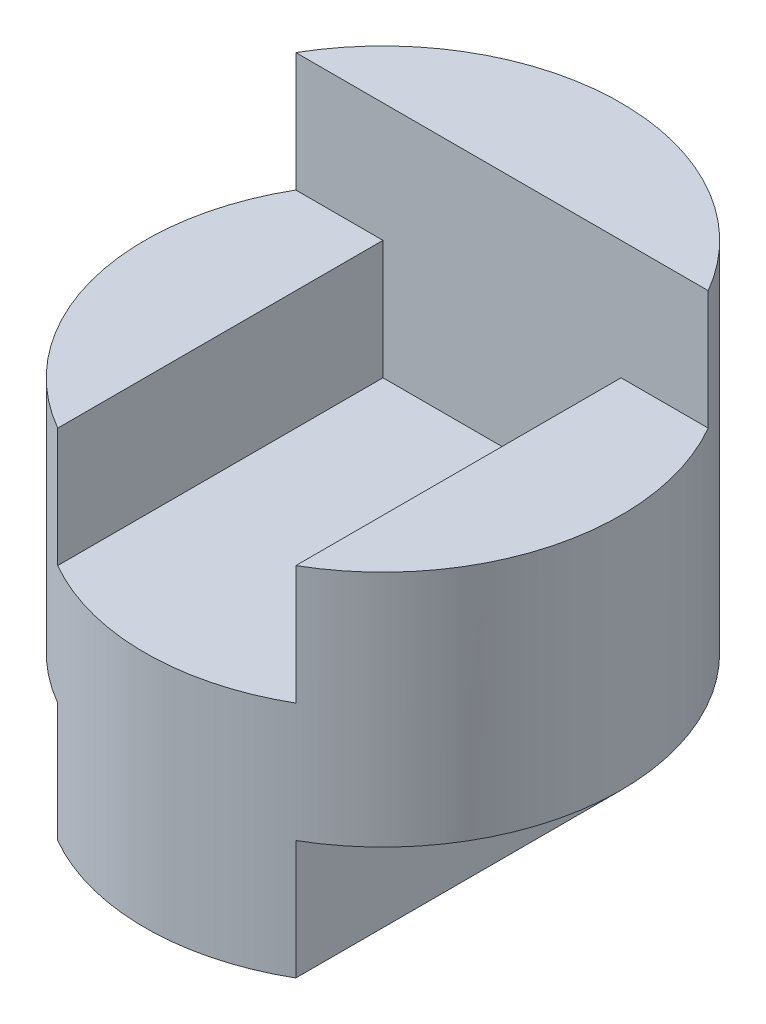
ISO-10303-21;
HEADER;
FILE_DESCRIPTION(('STEP AP214'),'2;1');
FILE_NAME('part.step','',(''),(''),'','','');
FILE_SCHEMA(('AUTOMOTIVE_DESIGN { 1 0 10303 214 1 1 1 1 }'));
ENDSEC;
DATA;
#1=APPLICATION_CONTEXT('core data for automotive mechanical design processes');
#2=APPLICATION_PROTOCOL_DEFINITION('international standard','automotive_design',2000,#1);
#3=PRODUCT_CONTEXT('',#1,'mechanical');
#4=PRODUCT('Part','Part','',(#3));
#5=PRODUCT_RELATED_PRODUCT_CATEGORY('part','',(#4));
#6=PRODUCT_DEFINITION_FORMATION('','',#4);
#7=PRODUCT_DEFINITION_CONTEXT('part definition',#1,'design');
#8=PRODUCT_DEFINITION('design','',#6,#7);
#9=PRODUCT_DEFINITION_SHAPE('','',#8);
#10=(LENGTH_UNIT() NAMED_UNIT(*) SI_UNIT(.MILLI.,.METRE.));
#11=(NAMED_UNIT(*) PLANE_ANGLE_UNIT() SI_UNIT($,.RADIAN.));
#12=(NAMED_UNIT(*) SI_UNIT($,.STERADIAN.) SOLID_ANGLE_UNIT());
#13=UNCERTAINTY_MEASURE_WITH_UNIT(LENGTH_MEASURE(1.E-05),#10,'distance_accuracy_value','');
#14=(GEOMETRIC_REPRESENTATION_CONTEXT(3) GLOBAL_UNCERTAINTY_ASSIGNED_CONTEXT((#13)) GLOBAL_UNIT_ASSIGNED_CONTEXT((#10,
#11,#12)) REPRESENTATION_CONTEXT('',''));
#15=CARTESIAN_POINT('',(0.,0.,0.));
#16=DIRECTION('',(0.,0.,1.));
#17=DIRECTION('',(1.,0.,0.));
#18=AXIS2_PLACEMENT_3D('',#15,#16,#17);
#19=CARTESIAN_POINT('',(0.,4.,0.));
#20=DIRECTION('',(0.,-1.,0.));
#21=DIRECTION('',(0.,0.,-1.));
#22=AXIS2_PLACEMENT_3D('',#19,#20,#21);
#23=CYLINDRICAL_SURFACE('',#22,2.);
#24=CARTESIAN_POINT('',(0.,1.,0.));
#25=DIRECTION('',(0.,1.,0.));
#26=DIRECTION('',(0.,0.,1.));
#27=AXIS2_PLACEMENT_3D('',#24,#25,#26);
#28=CIRCLE('',#27,2.);
#29=CARTESIAN_POINT('',(1.,1.,1.73205080756888));
#30=VERTEX_POINT('',#29);
#31=CARTESIAN_POINT('',(-1.,1.,1.73205080756888));
#32=VERTEX_POINT('',#31);
#33=EDGE_CURVE('E126',#30,#32,#28,.T.);
#34=ORIENTED_EDGE('',*,*,#33,.T.);
#35=DIRECTION('',(0.,-1.,0.));
#36=VECTOR('',#35,1.);
#37=CARTESIAN_POINT('',(-1.,4.,1.73205080756888));
#38=LINE('',#37,#36);
#39=CARTESIAN_POINT('',(-1.,0.,1.73205080756888));
#40=VERTEX_POINT('',#39);
#41=EDGE_CURVE('E136',#32,#40,#38,.T.);
#42=ORIENTED_EDGE('',*,*,#41,.T.);
#43=CARTESIAN_POINT('',(0.,0.,0.));
#44=DIRECTION('',(0.,1.,0.));
#45=DIRECTION('',(0.,0.,1.));
#46=AXIS2_PLACEMENT_3D('',#43,#44,#45);
#47=CIRCLE('',#46,2.);
#48=CARTESIAN_POINT('',(1.,0.,1.73205080756888));
#49=VERTEX_POINT('',#48);
#50=EDGE_CURVE('E139',#40,#49,#47,.T.);
#51=ORIENTED_EDGE('',*,*,#50,.T.);
#52=DIRECTION('',(0.,-1.,0.));
#53=VECTOR('',#52,1.);
#54=CARTESIAN_POINT('',(1.,4.,1.73205080756888));
#55=LINE('',#54,#53);
#56=EDGE_CURVE('E130',#49,#30,#55,.F.);
#57=ORIENTED_EDGE('',*,*,#56,.T.);
#58=EDGE_LOOP('',(#34,#42,#51,#57));
#59=FACE_BOUND('',#58,.T.);
#60=DIRECTION('',(0.,-1.,0.));
#61=VECTOR('',#60,1.);
#62=CARTESIAN_POINT('',(1.73205080756888,4.,-1.));
#63=LINE('',#62,#61);
#64=CARTESIAN_POINT('',(1.73205080756888,4.,-1.));
#65=VERTEX_POINT('',#64);
#66=CARTESIAN_POINT('',(1.73205080756888,3.,-1.));
#67=VERTEX_POINT('',#66);
#68=EDGE_CURVE('E55',#65,#67,#63,.T.);
#69=ORIENTED_EDGE('',*,*,#68,.T.);
#70=CARTESIAN_POINT('',(0.,3.,0.));
#71=DIRECTION('',(0.,1.,0.));
#72=DIRECTION('',(0.,0.,1.));
#73=AXIS2_PLACEMENT_3D('',#70,#71,#72);
#74=CIRCLE('',#73,2.);
#75=CARTESIAN_POINT('',(1.,3.,1.73205080756888));
#76=VERTEX_POINT('',#75);
#77=EDGE_CURVE('E40',#76,#67,#74,.T.);
#78=ORIENTED_EDGE('',*,*,#77,.F.);
#79=DIRECTION('',(0.,-1.,0.));
#80=VECTOR('',#79,1.);
#81=CARTESIAN_POINT('',(1.,4.,1.73205080756888));
#82=LINE('',#81,#80);
#83=CARTESIAN_POINT('',(1.,2.,1.73205080756888));
#84=VERTEX_POINT('',#83);
#85=EDGE_CURVE('E158',#84,#76,#82,.F.);
#86=ORIENTED_EDGE('',*,*,#85,.F.);
#87=CARTESIAN_POINT('',(0.,2.,0.));
#88=DIRECTION('',(0.,1.,0.));
#89=DIRECTION('',(-1.,0.,0.));
#90=AXIS2_PLACEMENT_3D('',#87,#88,#89);
#91=CIRCLE('',#90,2.);
#92=CARTESIAN_POINT('',(-1.,2.,1.73205080756888));
#93=VERTEX_POINT('',#92);
#94=EDGE_CURVE('E156',#93,#84,#91,.T.);
#95=ORIENTED_EDGE('',*,*,#94,.F.);
#96=DIRECTION('',(0.,-1.,0.));
#97=VECTOR('',#96,1.);
#98=CARTESIAN_POINT('',(-1.,4.,1.73205080756888));
#99=LINE('',#98,#97);
#100=CARTESIAN_POINT('',(-1.,3.,1.73205080756888));
#101=VERTEX_POINT('',#100);
#102=EDGE_CURVE('E154',#101,#93,#99,.T.);
#103=ORIENTED_EDGE('',*,*,#102,.F.);
#104=CARTESIAN_POINT('',(0.,3.,0.));
#105=DIRECTION('',(0.,1.,0.));
#106=DIRECTION('',(-1.,0.,0.));
#107=AXIS2_PLACEMENT_3D('',#104,#105,#106);
#108=CIRCLE('',#107,2.);
#109=CARTESIAN_POINT('',(-1.73205080756888,3.,-1.));
#110=VERTEX_POINT('',#109);
#111=EDGE_CURVE('E152',#110,#101,#108,.T.);
#112=ORIENTED_EDGE('',*,*,#111,.F.);
#113=DIRECTION('',(0.,-1.,0.));
#114=VECTOR('',#113,1.);
#115=CARTESIAN_POINT('',(-1.73205080756888,4.,-1.));
#116=LINE('',#115,#114);
#117=CARTESIAN_POINT('',(-1.73205080756888,4.,-1.));
#118=VERTEX_POINT('',#117);
#119=EDGE_CURVE('E132',#110,#118,#116,.F.);
#120=ORIENTED_EDGE('',*,*,#119,.T.);
#121=CARTESIAN_POINT('',(0.,4.,0.));
#122=DIRECTION('',(0.,1.,0.));
#123=DIRECTION('',(0.,0.,1.));
#124=AXIS2_PLACEMENT_3D('',#121,#122,#123);
#125=CIRCLE('',#124,2.);
#126=EDGE_CURVE('E140',#65,#118,#125,.T.);
#127=ORIENTED_EDGE('',*,*,#126,.F.);
#128=EDGE_LOOP('',(#69,#78,#86,#95,#103,#112,#120,#127));
#129=FACE_BOUND('',#128,.T.);
#130=ADVANCED_FACE('F33',(#59,#129),#23,.T.);
#131=CARTESIAN_POINT('',(0.,4.,0.));
#132=DIRECTION('',(0.,1.,0.));
#133=DIRECTION('',(0.,0.,1.));
#134=AXIS2_PLACEMENT_3D('',#131,#132,#133);
#135=PLANE('',#134);
#136=DIRECTION('',(-1.,0.,0.));
#137=VECTOR('',#136,1.);
#138=CARTESIAN_POINT('',(0.,4.,-1.));
#139=LINE('',#138,#137);
#140=EDGE_CURVE('E150',#65,#118,#139,.T.);
#141=ORIENTED_EDGE('',*,*,#140,.F.);
#142=ORIENTED_EDGE('',*,*,#126,.T.);
#143=EDGE_LOOP('',(#141,#142));
#144=FACE_BOUND('',#143,.T.);
#145=ADVANCED_FACE('F178',(#144),#135,.T.);
#146=CARTESIAN_POINT('',(0.,0.,0.));
#147=DIRECTION('',(0.,1.,0.));
#148=DIRECTION('',(0.,0.,1.));
#149=AXIS2_PLACEMENT_3D('',#146,#147,#148);
#150=PLANE('',#149);
#151=DIRECTION('',(0.,0.,-1.));
#152=VECTOR('',#151,1.);
#153=CARTESIAN_POINT('',(-1.,0.,0.));
#154=LINE('',#153,#152);
#155=CARTESIAN_POINT('',(-1.,0.,-1.));
#156=VERTEX_POINT('',#155);
#157=EDGE_CURVE('E146',#40,#156,#154,.T.);
#158=ORIENTED_EDGE('',*,*,#157,.T.);
#159=DIRECTION('',(1.,0.,0.));
#160=VECTOR('',#159,1.);
#161=CARTESIAN_POINT('',(-5.,0.,-1.));
#162=LINE('',#161,#160);
#163=CARTESIAN_POINT('',(1.,0.,-1.));
#164=VERTEX_POINT('',#163);
#165=EDGE_CURVE('E114',#156,#164,#162,.T.);
#166=ORIENTED_EDGE('',*,*,#165,.T.);
#167=DIRECTION('',(0.,0.,1.));
#168=VECTOR('',#167,1.);
#169=CARTESIAN_POINT('',(1.,0.,0.));
#170=LINE('',#169,#168);
#171=EDGE_CURVE('E122',#164,#49,#170,.T.);
#172=ORIENTED_EDGE('',*,*,#171,.T.);
#173=ORIENTED_EDGE('',*,*,#50,.F.);
#174=EDGE_LOOP('',(#158,#166,#172,#173));
#175=FACE_BOUND('',#174,.T.);
#176=ADVANCED_FACE('F211',(#175),#150,.F.);
#177=CARTESIAN_POINT('',(1.,0.,-2.));
#178=DIRECTION('',(-1.,0.,0.));
#179=DIRECTION('',(0.,0.,1.));
#180=AXIS2_PLACEMENT_3D('',#177,#178,#179);
#181=PLANE('',#180);
#182=ORIENTED_EDGE('',*,*,#171,.F.);
#183=DIRECTION('',(0.,1.,0.));
#184=VECTOR('',#183,1.);
#185=CARTESIAN_POINT('',(1.,0.,-1.));
#186=LINE('',#185,#184);
#187=CARTESIAN_POINT('',(1.,1.,-1.));
#188=VERTEX_POINT('',#187);
#189=EDGE_CURVE('E111',#164,#188,#186,.T.);
#190=ORIENTED_EDGE('',*,*,#189,.T.);
#191=DIRECTION('',(0.,0.,1.));
#192=VECTOR('',#191,1.);
#193=CARTESIAN_POINT('',(1.,1.,-2.));
#194=LINE('',#193,#192);
#195=EDGE_CURVE('E120',#188,#30,#194,.T.);
#196=ORIENTED_EDGE('',*,*,#195,.T.);
#197=ORIENTED_EDGE('',*,*,#56,.F.);
#198=EDGE_LOOP('',(#182,#190,#196,#197));
#199=FACE_BOUND('',#198,.T.);
#200=ADVANCED_FACE('F118',(#199),#181,.F.);
#201=CARTESIAN_POINT('',(-2.,1.,-2.));
#202=DIRECTION('',(0.,1.,0.));
#203=DIRECTION('',(0.,0.,1.));
#204=AXIS2_PLACEMENT_3D('',#201,#202,#203);
#205=PLANE('',#204);
#206=DIRECTION('',(0.,0.,1.));
#207=VECTOR('',#206,1.);
#208=CARTESIAN_POINT('',(-1.,1.,-2.));
#209=LINE('',#208,#207);
#210=CARTESIAN_POINT('',(-1.,1.,-1.));
#211=VERTEX_POINT('',#210);
#212=EDGE_CURVE('E128',#211,#32,#209,.T.);
#213=ORIENTED_EDGE('',*,*,#212,.T.);
#214=ORIENTED_EDGE('',*,*,#33,.F.);
#215=ORIENTED_EDGE('',*,*,#195,.F.);
#216=DIRECTION('',(1.,0.,0.));
#217=VECTOR('',#216,1.);
#218=CARTESIAN_POINT('',(-5.,1.,-1.));
#219=LINE('',#218,#217);
#220=EDGE_CURVE('E47',#211,#188,#219,.T.);
#221=ORIENTED_EDGE('',*,*,#220,.F.);
#222=EDGE_LOOP('',(#213,#214,#215,#221));
#223=FACE_BOUND('',#222,.T.);
#224=ADVANCED_FACE('F125',(#223),#205,.F.);
#225=CARTESIAN_POINT('',(-1.,0.,-2.));
#226=DIRECTION('',(1.,0.,0.));
#227=DIRECTION('',(0.,0.,-1.));
#228=AXIS2_PLACEMENT_3D('',#225,#226,#227);
#229=PLANE('',#228);
#230=ORIENTED_EDGE('',*,*,#212,.F.);
#231=DIRECTION('',(0.,-1.,0.));
#232=VECTOR('',#231,1.);
#233=CARTESIAN_POINT('',(-1.,0.,-1.));
#234=LINE('',#233,#232);
#235=EDGE_CURVE('E11',#211,#156,#234,.T.);
#236=ORIENTED_EDGE('',*,*,#235,.T.);
#237=ORIENTED_EDGE('',*,*,#157,.F.);
#238=ORIENTED_EDGE('',*,*,#41,.F.);
#239=EDGE_LOOP('',(#230,#236,#237,#238));
#240=FACE_BOUND('',#239,.T.);
#241=ADVANCED_FACE('F214',(#240),#229,.F.);
#242=CARTESIAN_POINT('',(-1.,3.,4.));
#243=DIRECTION('',(0.,1.,0.));
#244=DIRECTION('',(-1.,0.,0.));
#245=AXIS2_PLACEMENT_3D('',#242,#243,#244);
#246=PLANE('',#245);
#247=ORIENTED_EDGE('',*,*,#111,.T.);
#248=DIRECTION('',(0.,0.,-1.));
#249=VECTOR('',#248,1.);
#250=CARTESIAN_POINT('',(-1.,3.,4.));
#251=LINE('',#250,#249);
#252=CARTESIAN_POINT('',(-1.,3.,-1.));
#253=VERTEX_POINT('',#252);
#254=EDGE_CURVE('E183',#101,#253,#251,.T.);
#255=ORIENTED_EDGE('',*,*,#254,.T.);
#256=DIRECTION('',(1.,0.,0.));
#257=VECTOR('',#256,1.);
#258=CARTESIAN_POINT('',(-1.,3.,-1.));
#259=LINE('',#258,#257);
#260=EDGE_CURVE('E123',#110,#253,#259,.T.);
#261=ORIENTED_EDGE('',*,*,#260,.F.);
#262=EDGE_LOOP('',(#247,#255,#261));
#263=FACE_BOUND('',#262,.T.);
#264=ADVANCED_FACE('F186',(#263),#246,.T.);
#265=CARTESIAN_POINT('',(-1.,2.,4.));
#266=DIRECTION('',(1.,0.,0.));
#267=DIRECTION('',(0.,1.,0.));
#268=AXIS2_PLACEMENT_3D('',#265,#266,#267);
#269=PLANE('',#268);
#270=ORIENTED_EDGE('',*,*,#102,.T.);
#271=DIRECTION('',(0.,0.,-1.));
#272=VECTOR('',#271,1.);
#273=CARTESIAN_POINT('',(-1.,2.,4.));
#274=LINE('',#273,#272);
#275=CARTESIAN_POINT('',(-1.,2.,-1.));
#276=VERTEX_POINT('',#275);
#277=EDGE_CURVE('E195',#93,#276,#274,.T.);
#278=ORIENTED_EDGE('',*,*,#277,.T.);
#279=DIRECTION('',(0.,-1.,0.));
#280=VECTOR('',#279,1.);
#281=CARTESIAN_POINT('',(-1.,2.,-1.));
#282=LINE('',#281,#280);
#283=EDGE_CURVE('E188',#253,#276,#282,.T.);
#284=ORIENTED_EDGE('',*,*,#283,.F.);
#285=ORIENTED_EDGE('',*,*,#254,.F.);
#286=EDGE_LOOP('',(#270,#278,#284,#285));
#287=FACE_BOUND('',#286,.T.);
#288=ADVANCED_FACE('F194',(#287),#269,.T.);
#289=CARTESIAN_POINT('',(1.,2.,4.));
#290=DIRECTION('',(0.,1.,0.));
#291=DIRECTION('',(-1.,0.,0.));
#292=AXIS2_PLACEMENT_3D('',#289,#290,#291);
#293=PLANE('',#292);
#294=ORIENTED_EDGE('',*,*,#94,.T.);
#295=DIRECTION('',(0.,0.,-1.));
#296=VECTOR('',#295,1.);
#297=CARTESIAN_POINT('',(1.,2.,4.));
#298=LINE('',#297,#296);
#299=CARTESIAN_POINT('',(1.,2.,-1.));
#300=VERTEX_POINT('',#299);
#301=EDGE_CURVE('E201',#84,#300,#298,.T.);
#302=ORIENTED_EDGE('',*,*,#301,.T.);
#303=DIRECTION('',(1.,0.,0.));
#304=VECTOR('',#303,1.);
#305=CARTESIAN_POINT('',(1.,2.,-1.));
#306=LINE('',#305,#304);
#307=EDGE_CURVE('E200',#276,#300,#306,.T.);
#308=ORIENTED_EDGE('',*,*,#307,.F.);
#309=ORIENTED_EDGE('',*,*,#277,.F.);
#310=EDGE_LOOP('',(#294,#302,#308,#309));
#311=FACE_BOUND('',#310,.T.);
#312=ADVANCED_FACE('F198',(#311),#293,.T.);
#313=CARTESIAN_POINT('',(1.,3.,4.));
#314=DIRECTION('',(-1.,0.,0.));
#315=DIRECTION('',(0.,-1.,0.));
#316=AXIS2_PLACEMENT_3D('',#313,#314,#315);
#317=PLANE('',#316);
#318=ORIENTED_EDGE('',*,*,#85,.T.);
#319=DIRECTION('',(0.,0.,-1.));
#320=VECTOR('',#319,1.);
#321=CARTESIAN_POINT('',(1.,3.,4.));
#322=LINE('',#321,#320);
#323=CARTESIAN_POINT('',(1.,3.,-1.));
#324=VERTEX_POINT('',#323);
#325=EDGE_CURVE('E166',#76,#324,#322,.T.);
#326=ORIENTED_EDGE('',*,*,#325,.T.);
#327=DIRECTION('',(0.,1.,0.));
#328=VECTOR('',#327,1.);
#329=CARTESIAN_POINT('',(1.,3.,-1.));
#330=LINE('',#329,#328);
#331=EDGE_CURVE('E172',#300,#324,#330,.T.);
#332=ORIENTED_EDGE('',*,*,#331,.F.);
#333=ORIENTED_EDGE('',*,*,#301,.F.);
#334=EDGE_LOOP('',(#318,#326,#332,#333));
#335=FACE_BOUND('',#334,.T.);
#336=ADVANCED_FACE('F240',(#335),#317,.T.);
#337=CARTESIAN_POINT('',(2.,3.,4.));
#338=DIRECTION('',(0.,1.,0.));
#339=DIRECTION('',(0.,0.,1.));
#340=AXIS2_PLACEMENT_3D('',#337,#338,#339);
#341=PLANE('',#340);
#342=ORIENTED_EDGE('',*,*,#77,.T.);
#343=DIRECTION('',(1.,0.,0.));
#344=VECTOR('',#343,1.);
#345=CARTESIAN_POINT('',(2.,3.,-1.));
#346=LINE('',#345,#344);
#347=EDGE_CURVE('E164',#324,#67,#346,.T.);
#348=ORIENTED_EDGE('',*,*,#347,.F.);
#349=ORIENTED_EDGE('',*,*,#325,.F.);
#350=EDGE_LOOP('',(#342,#348,#349));
#351=FACE_BOUND('',#350,.T.);
#352=ADVANCED_FACE('F163',(#351),#341,.T.);
#353=CARTESIAN_POINT('',(0.,0.,-1.));
#354=DIRECTION('',(0.,0.,-1.));
#355=DIRECTION('',(-1.,0.,0.));
#356=AXIS2_PLACEMENT_3D('',#353,#354,#355);
#357=PLANE('',#356);
#358=ORIENTED_EDGE('',*,*,#140,.T.);
#359=ORIENTED_EDGE('',*,*,#119,.F.);
#360=ORIENTED_EDGE('',*,*,#260,.T.);
#361=ORIENTED_EDGE('',*,*,#283,.T.);
#362=ORIENTED_EDGE('',*,*,#307,.T.);
#363=ORIENTED_EDGE('',*,*,#331,.T.);
#364=ORIENTED_EDGE('',*,*,#347,.T.);
#365=ORIENTED_EDGE('',*,*,#68,.F.);
#366=EDGE_LOOP('',(#358,#359,#360,#361,#362,#363,#364,#365));
#367=FACE_BOUND('',#366,.T.);
#368=ADVANCED_FACE('F169',(#367),#357,.F.);
#369=CARTESIAN_POINT('',(-5.,0.,-1.));
#370=DIRECTION('',(0.,0.,1.));
#371=DIRECTION('',(1.,0.,0.));
#372=AXIS2_PLACEMENT_3D('',#369,#370,#371);
#373=PLANE('',#372);
#374=ORIENTED_EDGE('',*,*,#165,.F.);
#375=ORIENTED_EDGE('',*,*,#235,.F.);
#376=ORIENTED_EDGE('',*,*,#220,.T.);
#377=ORIENTED_EDGE('',*,*,#189,.F.);
#378=EDGE_LOOP('',(#374,#375,#376,#377));
#379=FACE_BOUND('',#378,.T.);
#380=ADVANCED_FACE('F110',(#379),#373,.F.);
#381=CLOSED_SHELL('',(#130,#145,#176,#200,#224,#241,#264,#288,#312,#336,#352,#368,#380));
#382=MANIFOLD_SOLID_BREP('B2',#381);
#383=ADVANCED_BREP_SHAPE_REPRESENTATION('',(#18,#382),#14);
#384=SHAPE_DEFINITION_REPRESENTATION(#9,#383);
ENDSEC;
END-ISO-10303-21;
